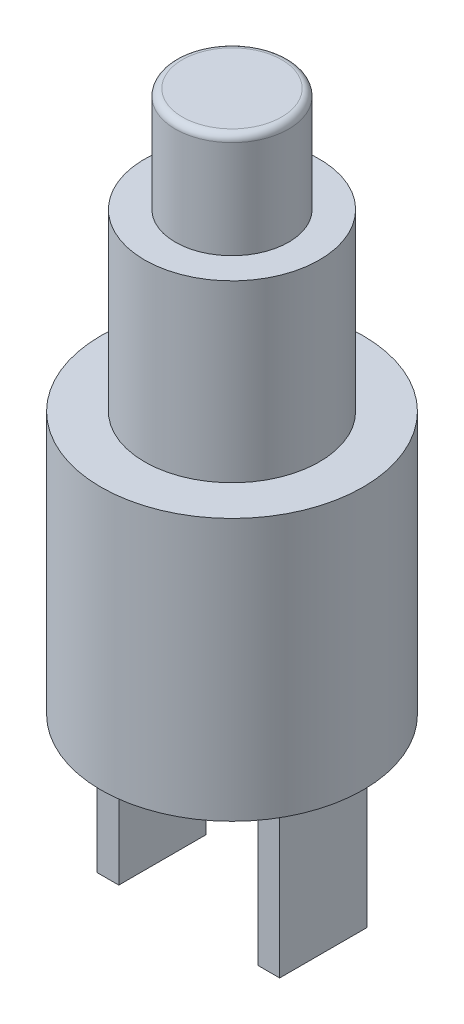
ISO-10303-21;
HEADER;
FILE_DESCRIPTION(('STEP AP214'),'2;1');
FILE_NAME('part.step','',(''),(''),'','','');
FILE_SCHEMA(('AUTOMOTIVE_DESIGN { 1 0 10303 214 1 1 1 1 }'));
ENDSEC;
DATA;
#1=APPLICATION_CONTEXT('core data for automotive mechanical design processes');
#2=APPLICATION_PROTOCOL_DEFINITION('international standard','automotive_design',2000,#1);
#3=PRODUCT_CONTEXT('',#1,'mechanical');
#4=PRODUCT('Part','Part','',(#3));
#5=PRODUCT_RELATED_PRODUCT_CATEGORY('part','',(#4));
#6=PRODUCT_DEFINITION_FORMATION('','',#4);
#7=PRODUCT_DEFINITION_CONTEXT('part definition',#1,'design');
#8=PRODUCT_DEFINITION('design','',#6,#7);
#9=PRODUCT_DEFINITION_SHAPE('','',#8);
#10=(LENGTH_UNIT() NAMED_UNIT(*) SI_UNIT(.MILLI.,.METRE.));
#11=(NAMED_UNIT(*) PLANE_ANGLE_UNIT() SI_UNIT($,.RADIAN.));
#12=(NAMED_UNIT(*) SI_UNIT($,.STERADIAN.) SOLID_ANGLE_UNIT());
#13=UNCERTAINTY_MEASURE_WITH_UNIT(LENGTH_MEASURE(1.E-05),#10,'distance_accuracy_value','');
#14=(GEOMETRIC_REPRESENTATION_CONTEXT(3) GLOBAL_UNCERTAINTY_ASSIGNED_CONTEXT((#13)) GLOBAL_UNIT_ASSIGNED_CONTEXT((#10,
#11,#12)) REPRESENTATION_CONTEXT('',''));
#15=CARTESIAN_POINT('',(0.,0.,0.));
#16=DIRECTION('',(0.,0.,1.));
#17=DIRECTION('',(1.,0.,0.));
#18=AXIS2_PLACEMENT_3D('',#15,#16,#17);
#19=CARTESIAN_POINT('',(0.,-9.52500000000001,0.));
#20=DIRECTION('',(0.,1.,0.));
#21=DIRECTION('',(0.,0.,1.00000000000001));
#22=AXIS2_PLACEMENT_3D('',#19,#20,#21);
#23=PLANE('',#22);
#24=DIRECTION('',(0.,0.,-1.00000000000001));
#25=VECTOR('',#24,1.);
#26=CARTESIAN_POINT('',(2.52412499999999,-9.52500000000001,-1.58750000000001));
#27=LINE('',#26,#25);
#28=CARTESIAN_POINT('',(2.52412499999999,-9.52500000000001,1.58750000000001));
#29=VERTEX_POINT('',#28);
#30=CARTESIAN_POINT('',(2.52412499999999,-9.52500000000001,-1.58750000000001));
#31=VERTEX_POINT('',#30);
#32=EDGE_CURVE('E137',#29,#31,#27,.T.);
#33=ORIENTED_EDGE('',*,*,#32,.F.);
#34=DIRECTION('',(-1.00000000000001,0.,0.));
#35=VECTOR('',#34,1.);
#36=CARTESIAN_POINT('',(3.317875,-9.52500000000001,1.58750000000001));
#37=LINE('',#36,#35);
#38=CARTESIAN_POINT('',(3.317875,-9.52500000000001,1.58750000000001));
#39=VERTEX_POINT('',#38);
#40=EDGE_CURVE('E150',#39,#29,#37,.T.);
#41=ORIENTED_EDGE('',*,*,#40,.F.);
#42=DIRECTION('',(0.,0.,1.00000000000001));
#43=VECTOR('',#42,1.);
#44=CARTESIAN_POINT('',(3.317875,-9.52500000000001,-1.58750000000001));
#45=LINE('',#44,#43);
#46=CARTESIAN_POINT('',(3.317875,-9.52500000000001,-1.58750000000001));
#47=VERTEX_POINT('',#46);
#48=EDGE_CURVE('E159',#47,#39,#45,.T.);
#49=ORIENTED_EDGE('',*,*,#48,.F.);
#50=DIRECTION('',(1.00000000000001,0.,0.));
#51=VECTOR('',#50,1.);
#52=CARTESIAN_POINT('',(3.317875,-9.52500000000001,-1.58750000000001));
#53=LINE('',#52,#51);
#54=EDGE_CURVE('E140',#31,#47,#53,.T.);
#55=ORIENTED_EDGE('',*,*,#54,.F.);
#56=EDGE_LOOP('',(#33,#41,#49,#55));
#57=FACE_BOUND('',#56,.T.);
#58=CARTESIAN_POINT('',(0.,-9.52500000000001,0.));
#59=DIRECTION('',(0.,1.,0.));
#60=DIRECTION('',(0.,0.,1.00000000000001));
#61=AXIS2_PLACEMENT_3D('',#58,#59,#60);
#62=CIRCLE('',#61,4.7625);
#63=CARTESIAN_POINT('',(0.,-9.52500000000001,4.76250000000006));
#64=VERTEX_POINT('',#63);
#65=EDGE_CURVE('E185',#64,#64,#62,.T.);
#66=ORIENTED_EDGE('',*,*,#65,.F.);
#67=EDGE_LOOP('',(#66));
#68=FACE_BOUND('',#67,.T.);
#69=DIRECTION('',(0.,0.,-1.00000000000001));
#70=VECTOR('',#69,1.);
#71=CARTESIAN_POINT('',(-3.317875,-9.52500000000001,-1.58750000000001));
#72=LINE('',#71,#70);
#73=CARTESIAN_POINT('',(-3.317875,-9.52500000000001,1.58750000000001));
#74=VERTEX_POINT('',#73);
#75=CARTESIAN_POINT('',(-3.317875,-9.52500000000001,-1.58750000000001));
#76=VERTEX_POINT('',#75);
#77=EDGE_CURVE('E136',#74,#76,#72,.T.);
#78=ORIENTED_EDGE('',*,*,#77,.F.);
#79=DIRECTION('',(-1.00000000000001,0.,0.));
#80=VECTOR('',#79,1.);
#81=CARTESIAN_POINT('',(-3.317875,-9.52500000000001,1.58750000000001));
#82=LINE('',#81,#80);
#83=CARTESIAN_POINT('',(-2.52412499999999,-9.52500000000001,1.58750000000001));
#84=VERTEX_POINT('',#83);
#85=EDGE_CURVE('E133',#84,#74,#82,.T.);
#86=ORIENTED_EDGE('',*,*,#85,.F.);
#87=DIRECTION('',(0.,0.,1.00000000000001));
#88=VECTOR('',#87,1.);
#89=CARTESIAN_POINT('',(-2.52412499999999,-9.52500000000001,-1.58750000000001));
#90=LINE('',#89,#88);
#91=CARTESIAN_POINT('',(-2.52412499999999,-9.52500000000001,-1.58750000000001));
#92=VERTEX_POINT('',#91);
#93=EDGE_CURVE('E71',#92,#84,#90,.T.);
#94=ORIENTED_EDGE('',*,*,#93,.F.);
#95=DIRECTION('',(1.00000000000001,0.,0.));
#96=VECTOR('',#95,1.);
#97=CARTESIAN_POINT('',(-3.317875,-9.52500000000001,-1.58750000000001));
#98=LINE('',#97,#96);
#99=EDGE_CURVE('E66',#76,#92,#98,.T.);
#100=ORIENTED_EDGE('',*,*,#99,.F.);
#101=EDGE_LOOP('',(#78,#86,#94,#100));
#102=FACE_BOUND('',#101,.T.);
#103=ADVANCED_FACE('F51',(#57,#68,#102),#23,.F.);
#104=CARTESIAN_POINT('',(0.,-9.52500000000001,0.));
#105=DIRECTION('',(0.,1.,0.));
#106=DIRECTION('',(0.,0.,1.00000000000001));
#107=AXIS2_PLACEMENT_3D('',#104,#105,#106);
#108=CYLINDRICAL_SURFACE('',#107,4.7625);
#109=ORIENTED_EDGE('',*,*,#65,.T.);
#110=EDGE_LOOP('',(#109));
#111=FACE_BOUND('',#110,.T.);
#112=CARTESIAN_POINT('',(0.,0.,0.));
#113=DIRECTION('',(0.,1.,0.));
#114=DIRECTION('',(0.,0.,1.00000000000001));
#115=AXIS2_PLACEMENT_3D('',#112,#113,#114);
#116=CIRCLE('',#115,4.7625);
#117=CARTESIAN_POINT('',(0.,0.,4.76250000000006));
#118=VERTEX_POINT('',#117);
#119=EDGE_CURVE('E182',#118,#118,#116,.T.);
#120=ORIENTED_EDGE('',*,*,#119,.F.);
#121=EDGE_LOOP('',(#120));
#122=FACE_BOUND('',#121,.T.);
#123=ADVANCED_FACE('F203',(#111,#122),#108,.T.);
#124=CARTESIAN_POINT('',(0.,0.,0.));
#125=DIRECTION('',(0.,1.,0.));
#126=DIRECTION('',(0.,0.,1.00000000000001));
#127=AXIS2_PLACEMENT_3D('',#124,#125,#126);
#128=PLANE('',#127);
#129=CARTESIAN_POINT('',(0.,0.,0.));
#130=DIRECTION('',(0.,1.,0.));
#131=DIRECTION('',(0.,0.,1.00000000000001));
#132=AXIS2_PLACEMENT_3D('',#129,#130,#131);
#133=CIRCLE('',#132,3.175);
#134=CARTESIAN_POINT('',(0.,0.,3.17500000000004));
#135=VERTEX_POINT('',#134);
#136=EDGE_CURVE('E178',#135,#135,#133,.T.);
#137=ORIENTED_EDGE('',*,*,#136,.F.);
#138=EDGE_LOOP('',(#137));
#139=FACE_BOUND('',#138,.T.);
#140=ORIENTED_EDGE('',*,*,#119,.T.);
#141=EDGE_LOOP('',(#140));
#142=FACE_BOUND('',#141,.T.);
#143=ADVANCED_FACE('F209',(#139,#142),#128,.T.);
#144=CARTESIAN_POINT('',(0.,6.34999999999999,0.));
#145=DIRECTION('',(0.,-1.,0.));
#146=DIRECTION('',(0.,0.,-1.00000000000001));
#147=AXIS2_PLACEMENT_3D('',#144,#145,#146);
#148=CYLINDRICAL_SURFACE('',#147,3.175);
#149=CARTESIAN_POINT('',(0.,6.34999999999999,0.));
#150=DIRECTION('',(0.,1.,0.));
#151=DIRECTION('',(0.,0.,1.00000000000001));
#152=AXIS2_PLACEMENT_3D('',#149,#150,#151);
#153=CIRCLE('',#152,3.175);
#154=CARTESIAN_POINT('',(0.,6.34999999999999,3.17500000000004));
#155=VERTEX_POINT('',#154);
#156=EDGE_CURVE('E179',#155,#155,#153,.T.);
#157=ORIENTED_EDGE('',*,*,#156,.F.);
#158=EDGE_LOOP('',(#157));
#159=FACE_BOUND('',#158,.T.);
#160=ORIENTED_EDGE('',*,*,#136,.T.);
#161=EDGE_LOOP('',(#160));
#162=FACE_BOUND('',#161,.T.);
#163=ADVANCED_FACE('F214',(#159,#162),#148,.T.);
#164=CARTESIAN_POINT('',(0.,6.34999999999999,0.));
#165=DIRECTION('',(0.,1.,0.));
#166=DIRECTION('',(0.,0.,1.00000000000001));
#167=AXIS2_PLACEMENT_3D('',#164,#165,#166);
#168=PLANE('',#167);
#169=CARTESIAN_POINT('',(0.,6.34999999999999,0.));
#170=DIRECTION('',(0.,1.,0.));
#171=DIRECTION('',(0.,0.,1.00000000000001));
#172=AXIS2_PLACEMENT_3D('',#169,#170,#171);
#173=CIRCLE('',#172,2.0574);
#174=CARTESIAN_POINT('',(0.,6.34999999999999,2.05740000000003));
#175=VERTEX_POINT('',#174);
#176=EDGE_CURVE('E175',#175,#175,#173,.T.);
#177=ORIENTED_EDGE('',*,*,#176,.F.);
#178=EDGE_LOOP('',(#177));
#179=FACE_BOUND('',#178,.T.);
#180=ORIENTED_EDGE('',*,*,#156,.T.);
#181=EDGE_LOOP('',(#180));
#182=FACE_BOUND('',#181,.T.);
#183=ADVANCED_FACE('F221',(#179,#182),#168,.T.);
#184=CARTESIAN_POINT('',(0.,10.16,0.));
#185=DIRECTION('',(0.,-1.,0.));
#186=DIRECTION('',(0.,0.,-1.00000000000001));
#187=AXIS2_PLACEMENT_3D('',#184,#185,#186);
#188=CYLINDRICAL_SURFACE('',#187,2.0574);
#189=CARTESIAN_POINT('',(0.,9.906,0.));
#190=DIRECTION('',(0.,1.,0.));
#191=DIRECTION('',(0.,0.,1.00000000000001));
#192=AXIS2_PLACEMENT_3D('',#189,#190,#191);
#193=CIRCLE('',#192,2.0574);
#194=CARTESIAN_POINT('',(0.,9.906,2.05740000000003));
#195=VERTEX_POINT('',#194);
#196=EDGE_CURVE('E13',#195,#195,#193,.F.);
#197=ORIENTED_EDGE('',*,*,#196,.T.);
#198=EDGE_LOOP('',(#197));
#199=FACE_BOUND('',#198,.T.);
#200=ORIENTED_EDGE('',*,*,#176,.T.);
#201=EDGE_LOOP('',(#200));
#202=FACE_BOUND('',#201,.T.);
#203=ADVANCED_FACE('F231',(#199,#202),#188,.T.);
#204=CARTESIAN_POINT('',(0.,10.16,0.));
#205=DIRECTION('',(0.,1.,0.));
#206=DIRECTION('',(0.,0.,1.00000000000001));
#207=AXIS2_PLACEMENT_3D('',#204,#205,#206);
#208=PLANE('',#207);
#209=CARTESIAN_POINT('',(0.,10.16,0.));
#210=DIRECTION('',(0.,1.,0.));
#211=DIRECTION('',(0.,0.,1.00000000000001));
#212=AXIS2_PLACEMENT_3D('',#209,#210,#211);
#213=CIRCLE('',#212,1.8034);
#214=CARTESIAN_POINT('',(0.,10.16,1.80340000000002));
#215=VERTEX_POINT('',#214);
#216=EDGE_CURVE('E59',#215,#215,#213,.T.);
#217=ORIENTED_EDGE('',*,*,#216,.T.);
#218=EDGE_LOOP('',(#217));
#219=FACE_BOUND('',#218,.T.);
#220=ADVANCED_FACE('F192',(#219),#208,.T.);
#221=CARTESIAN_POINT('',(2.52412499999999,-15.367,-1.58750000000001));
#222=DIRECTION('',(1.00000000000001,0.,0.));
#223=DIRECTION('',(0.,0.,-1.00000000000001));
#224=AXIS2_PLACEMENT_3D('',#221,#222,#223);
#225=PLANE('',#224);
#226=ORIENTED_EDGE('',*,*,#32,.T.);
#227=DIRECTION('',(0.,1.,0.));
#228=VECTOR('',#227,1.);
#229=CARTESIAN_POINT('',(2.52412499999999,-15.367,-1.58750000000001));
#230=LINE('',#229,#228);
#231=CARTESIAN_POINT('',(2.52412499999999,-15.367,-1.58750000000001));
#232=VERTEX_POINT('',#231);
#233=EDGE_CURVE('E172',#232,#31,#230,.T.);
#234=ORIENTED_EDGE('',*,*,#233,.F.);
#235=DIRECTION('',(0.,0.,-1.00000000000001));
#236=VECTOR('',#235,1.);
#237=CARTESIAN_POINT('',(2.52412499999999,-15.367,-1.58750000000001));
#238=LINE('',#237,#236);
#239=CARTESIAN_POINT('',(2.52412499999999,-15.367,1.58750000000001));
#240=VERTEX_POINT('',#239);
#241=EDGE_CURVE('E146',#240,#232,#238,.T.);
#242=ORIENTED_EDGE('',*,*,#241,.F.);
#243=DIRECTION('',(0.,1.,0.));
#244=VECTOR('',#243,1.);
#245=CARTESIAN_POINT('',(2.52412499999999,-15.367,1.58750000000001));
#246=LINE('',#245,#244);
#247=EDGE_CURVE('E155',#240,#29,#246,.T.);
#248=ORIENTED_EDGE('',*,*,#247,.T.);
#249=EDGE_LOOP('',(#226,#234,#242,#248));
#250=FACE_BOUND('',#249,.T.);
#251=ADVANCED_FACE('F244',(#250),#225,.F.);
#252=CARTESIAN_POINT('',(3.317875,-15.367,-1.58750000000001));
#253=DIRECTION('',(0.,0.,1.00000000000001));
#254=DIRECTION('',(1.00000000000001,0.,0.));
#255=AXIS2_PLACEMENT_3D('',#252,#253,#254);
#256=PLANE('',#255);
#257=ORIENTED_EDGE('',*,*,#54,.T.);
#258=DIRECTION('',(0.,1.,0.));
#259=VECTOR('',#258,1.);
#260=CARTESIAN_POINT('',(3.317875,-15.367,-1.58750000000001));
#261=LINE('',#260,#259);
#262=CARTESIAN_POINT('',(3.317875,-15.367,-1.58750000000001));
#263=VERTEX_POINT('',#262);
#264=EDGE_CURVE('E169',#263,#47,#261,.T.);
#265=ORIENTED_EDGE('',*,*,#264,.F.);
#266=DIRECTION('',(1.00000000000001,0.,0.));
#267=VECTOR('',#266,1.);
#268=CARTESIAN_POINT('',(3.317875,-15.367,-1.58750000000001));
#269=LINE('',#268,#267);
#270=EDGE_CURVE('E149',#232,#263,#269,.T.);
#271=ORIENTED_EDGE('',*,*,#270,.F.);
#272=ORIENTED_EDGE('',*,*,#233,.T.);
#273=EDGE_LOOP('',(#257,#265,#271,#272));
#274=FACE_BOUND('',#273,.T.);
#275=ADVANCED_FACE('F247',(#274),#256,.F.);
#276=CARTESIAN_POINT('',(3.317875,-15.367,-1.58750000000001));
#277=DIRECTION('',(-1.00000000000001,0.,0.));
#278=DIRECTION('',(0.,0.,1.00000000000001));
#279=AXIS2_PLACEMENT_3D('',#276,#277,#278);
#280=PLANE('',#279);
#281=ORIENTED_EDGE('',*,*,#48,.T.);
#282=DIRECTION('',(0.,1.,0.));
#283=VECTOR('',#282,1.);
#284=CARTESIAN_POINT('',(3.317875,-15.367,1.58750000000001));
#285=LINE('',#284,#283);
#286=CARTESIAN_POINT('',(3.317875,-15.367,1.58750000000001));
#287=VERTEX_POINT('',#286);
#288=EDGE_CURVE('E166',#287,#39,#285,.T.);
#289=ORIENTED_EDGE('',*,*,#288,.F.);
#290=DIRECTION('',(0.,0.,1.00000000000001));
#291=VECTOR('',#290,1.);
#292=CARTESIAN_POINT('',(3.317875,-15.367,-1.58750000000001));
#293=LINE('',#292,#291);
#294=EDGE_CURVE('E152',#263,#287,#293,.T.);
#295=ORIENTED_EDGE('',*,*,#294,.F.);
#296=ORIENTED_EDGE('',*,*,#264,.T.);
#297=EDGE_LOOP('',(#281,#289,#295,#296));
#298=FACE_BOUND('',#297,.T.);
#299=ADVANCED_FACE('F251',(#298),#280,.F.);
#300=CARTESIAN_POINT('',(3.317875,-15.367,1.58750000000001));
#301=DIRECTION('',(0.,0.,-1.00000000000001));
#302=DIRECTION('',(-1.00000000000001,0.,0.));
#303=AXIS2_PLACEMENT_3D('',#300,#301,#302);
#304=PLANE('',#303);
#305=ORIENTED_EDGE('',*,*,#40,.T.);
#306=ORIENTED_EDGE('',*,*,#247,.F.);
#307=DIRECTION('',(-1.00000000000001,0.,0.));
#308=VECTOR('',#307,1.);
#309=CARTESIAN_POINT('',(3.317875,-15.367,1.58750000000001));
#310=LINE('',#309,#308);
#311=EDGE_CURVE('E154',#287,#240,#310,.T.);
#312=ORIENTED_EDGE('',*,*,#311,.F.);
#313=ORIENTED_EDGE('',*,*,#288,.T.);
#314=EDGE_LOOP('',(#305,#306,#312,#313));
#315=FACE_BOUND('',#314,.T.);
#316=ADVANCED_FACE('F255',(#315),#304,.F.);
#317=CARTESIAN_POINT('',(0.,-15.367,0.));
#318=DIRECTION('',(0.,-1.,0.));
#319=DIRECTION('',(0.,0.,-1.00000000000001));
#320=AXIS2_PLACEMENT_3D('',#317,#318,#319);
#321=PLANE('',#320);
#322=ORIENTED_EDGE('',*,*,#241,.T.);
#323=ORIENTED_EDGE('',*,*,#270,.T.);
#324=ORIENTED_EDGE('',*,*,#294,.T.);
#325=ORIENTED_EDGE('',*,*,#311,.T.);
#326=EDGE_LOOP('',(#322,#323,#324,#325));
#327=FACE_BOUND('',#326,.T.);
#328=ADVANCED_FACE('F259',(#327),#321,.T.);
#329=CARTESIAN_POINT('',(-3.317875,-15.367,-1.58750000000001));
#330=DIRECTION('',(1.00000000000001,0.,0.));
#331=DIRECTION('',(0.,0.,-1.00000000000001));
#332=AXIS2_PLACEMENT_3D('',#329,#330,#331);
#333=PLANE('',#332);
#334=ORIENTED_EDGE('',*,*,#77,.T.);
#335=DIRECTION('',(0.,1.,0.));
#336=VECTOR('',#335,1.);
#337=CARTESIAN_POINT('',(-3.317875,-15.367,-1.58750000000001));
#338=LINE('',#337,#336);
#339=CARTESIAN_POINT('',(-3.317875,-15.367,-1.58750000000001));
#340=VERTEX_POINT('',#339);
#341=EDGE_CURVE('E117',#340,#76,#338,.T.);
#342=ORIENTED_EDGE('',*,*,#341,.F.);
#343=DIRECTION('',(0.,0.,-1.00000000000001));
#344=VECTOR('',#343,1.);
#345=CARTESIAN_POINT('',(-3.317875,-15.367,-1.58750000000001));
#346=LINE('',#345,#344);
#347=CARTESIAN_POINT('',(-3.317875,-15.367,1.58750000000001));
#348=VERTEX_POINT('',#347);
#349=EDGE_CURVE('E124',#348,#340,#346,.T.);
#350=ORIENTED_EDGE('',*,*,#349,.F.);
#351=DIRECTION('',(0.,1.,0.));
#352=VECTOR('',#351,1.);
#353=CARTESIAN_POINT('',(-3.317875,-15.367,1.58750000000001));
#354=LINE('',#353,#352);
#355=EDGE_CURVE('E278',#348,#74,#354,.T.);
#356=ORIENTED_EDGE('',*,*,#355,.T.);
#357=EDGE_LOOP('',(#334,#342,#350,#356));
#358=FACE_BOUND('',#357,.T.);
#359=ADVANCED_FACE('F135',(#358),#333,.F.);
#360=CARTESIAN_POINT('',(-3.317875,-15.367,-1.58750000000001));
#361=DIRECTION('',(0.,0.,1.00000000000001));
#362=DIRECTION('',(1.00000000000001,0.,0.));
#363=AXIS2_PLACEMENT_3D('',#360,#361,#362);
#364=PLANE('',#363);
#365=ORIENTED_EDGE('',*,*,#99,.T.);
#366=DIRECTION('',(0.,1.,0.));
#367=VECTOR('',#366,1.);
#368=CARTESIAN_POINT('',(-2.52412499999999,-15.367,-1.58750000000001));
#369=LINE('',#368,#367);
#370=CARTESIAN_POINT('',(-2.52412499999999,-15.367,-1.58750000000001));
#371=VERTEX_POINT('',#370);
#372=EDGE_CURVE('E120',#371,#92,#369,.T.);
#373=ORIENTED_EDGE('',*,*,#372,.F.);
#374=DIRECTION('',(1.00000000000001,0.,0.));
#375=VECTOR('',#374,1.);
#376=CARTESIAN_POINT('',(-3.317875,-15.367,-1.58750000000001));
#377=LINE('',#376,#375);
#378=EDGE_CURVE('E113',#340,#371,#377,.T.);
#379=ORIENTED_EDGE('',*,*,#378,.F.);
#380=ORIENTED_EDGE('',*,*,#341,.T.);
#381=EDGE_LOOP('',(#365,#373,#379,#380));
#382=FACE_BOUND('',#381,.T.);
#383=ADVANCED_FACE('F115',(#382),#364,.F.);
#384=CARTESIAN_POINT('',(-2.52412499999999,-15.367,-1.58750000000001));
#385=DIRECTION('',(-1.00000000000001,0.,0.));
#386=DIRECTION('',(0.,0.,1.00000000000001));
#387=AXIS2_PLACEMENT_3D('',#384,#385,#386);
#388=PLANE('',#387);
#389=ORIENTED_EDGE('',*,*,#93,.T.);
#390=DIRECTION('',(0.,1.,0.));
#391=VECTOR('',#390,1.);
#392=CARTESIAN_POINT('',(-2.52412499999999,-15.367,1.58750000000001));
#393=LINE('',#392,#391);
#394=CARTESIAN_POINT('',(-2.52412499999999,-15.367,1.58750000000001));
#395=VERTEX_POINT('',#394);
#396=EDGE_CURVE('E142',#395,#84,#393,.T.);
#397=ORIENTED_EDGE('',*,*,#396,.F.);
#398=DIRECTION('',(0.,0.,1.00000000000001));
#399=VECTOR('',#398,1.);
#400=CARTESIAN_POINT('',(-2.52412499999999,-15.367,-1.58750000000001));
#401=LINE('',#400,#399);
#402=EDGE_CURVE('E123',#371,#395,#401,.T.);
#403=ORIENTED_EDGE('',*,*,#402,.F.);
#404=ORIENTED_EDGE('',*,*,#372,.T.);
#405=EDGE_LOOP('',(#389,#397,#403,#404));
#406=FACE_BOUND('',#405,.T.);
#407=ADVANCED_FACE('F268',(#406),#388,.F.);
#408=CARTESIAN_POINT('',(-3.317875,-15.367,1.58750000000001));
#409=DIRECTION('',(0.,0.,-1.00000000000001));
#410=DIRECTION('',(-1.00000000000001,0.,0.));
#411=AXIS2_PLACEMENT_3D('',#408,#409,#410);
#412=PLANE('',#411);
#413=ORIENTED_EDGE('',*,*,#85,.T.);
#414=ORIENTED_EDGE('',*,*,#355,.F.);
#415=DIRECTION('',(-1.00000000000001,0.,0.));
#416=VECTOR('',#415,1.);
#417=CARTESIAN_POINT('',(-3.317875,-15.367,1.58750000000001));
#418=LINE('',#417,#416);
#419=EDGE_CURVE('E129',#395,#348,#418,.T.);
#420=ORIENTED_EDGE('',*,*,#419,.F.);
#421=ORIENTED_EDGE('',*,*,#396,.T.);
#422=EDGE_LOOP('',(#413,#414,#420,#421));
#423=FACE_BOUND('',#422,.T.);
#424=ADVANCED_FACE('F199',(#423),#412,.F.);
#425=CARTESIAN_POINT('',(0.,-15.367,0.));
#426=DIRECTION('',(0.,1.,0.));
#427=DIRECTION('',(0.,0.,1.00000000000001));
#428=AXIS2_PLACEMENT_3D('',#425,#426,#427);
#429=PLANE('',#428);
#430=ORIENTED_EDGE('',*,*,#349,.T.);
#431=ORIENTED_EDGE('',*,*,#378,.T.);
#432=ORIENTED_EDGE('',*,*,#402,.T.);
#433=ORIENTED_EDGE('',*,*,#419,.T.);
#434=EDGE_LOOP('',(#430,#431,#432,#433));
#435=FACE_BOUND('',#434,.T.);
#436=ADVANCED_FACE('F127',(#435),#429,.F.);
#437=CARTESIAN_POINT('',(0.,9.906,0.));
#438=DIRECTION('',(0.,1.,0.));
#439=DIRECTION('',(0.,0.,1.00000000000001));
#440=AXIS2_PLACEMENT_3D('',#437,#438,#439);
#441=TOROIDAL_SURFACE('',#440,1.8034,0.254);
#442=ORIENTED_EDGE('',*,*,#196,.F.);
#443=EDGE_LOOP('',(#442));
#444=FACE_BOUND('',#443,.T.);
#445=ORIENTED_EDGE('',*,*,#216,.F.);
#446=EDGE_LOOP('',(#445));
#447=FACE_BOUND('',#446,.T.);
#448=ADVANCED_FACE('F53',(#444,#447),#441,.T.);
#449=CLOSED_SHELL('',(#103,#123,#143,#163,#183,#203,#220,#251,#275,#299,#316,#328,#359,#383,
#407,#424,#436,#448));
#450=MANIFOLD_SOLID_BREP('B2',#449);
#451=ADVANCED_BREP_SHAPE_REPRESENTATION('',(#18,#450),#14);
#452=SHAPE_DEFINITION_REPRESENTATION(#9,#451);
ENDSEC;
END-ISO-10303-21;
